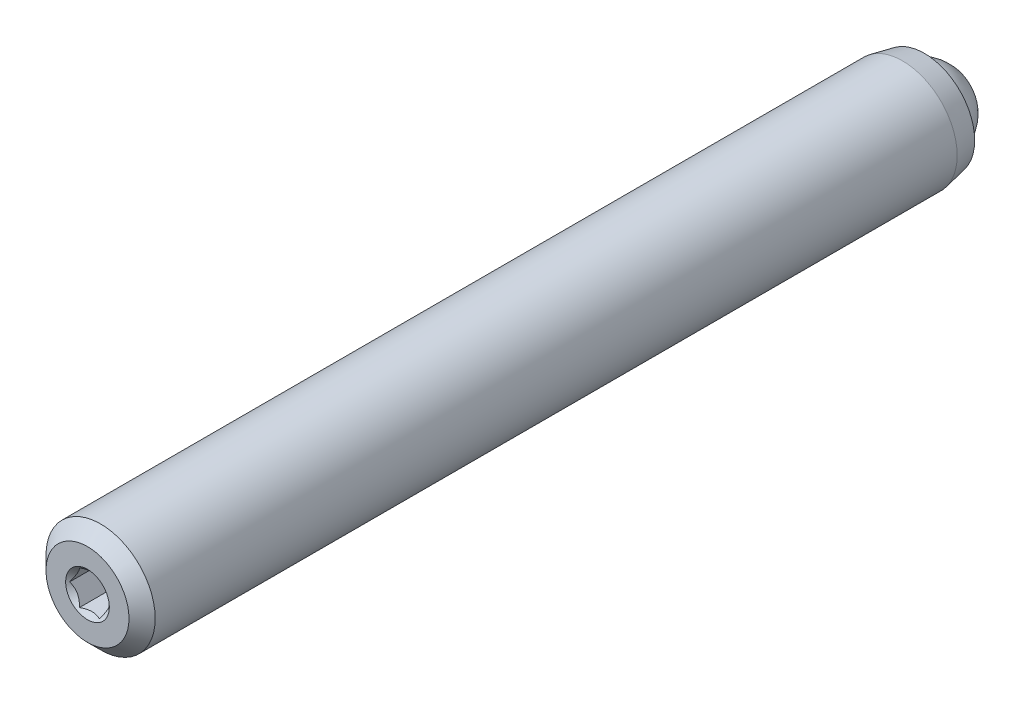
ISO-10303-21;
HEADER;
FILE_DESCRIPTION(('STEP AP214'),'2;1');
FILE_NAME('part.step','',(''),(''),'','','');
FILE_SCHEMA(('AUTOMOTIVE_DESIGN { 1 0 10303 214 1 1 1 1 }'));
ENDSEC;
DATA;
#1=APPLICATION_CONTEXT('core data for automotive mechanical design processes');
#2=APPLICATION_PROTOCOL_DEFINITION('international standard','automotive_design',2000,#1);
#3=PRODUCT_CONTEXT('',#1,'mechanical');
#4=PRODUCT('Part','Part','',(#3));
#5=PRODUCT_RELATED_PRODUCT_CATEGORY('part','',(#4));
#6=PRODUCT_DEFINITION_FORMATION('','',#4);
#7=PRODUCT_DEFINITION_CONTEXT('part definition',#1,'design');
#8=PRODUCT_DEFINITION('design','',#6,#7);
#9=PRODUCT_DEFINITION_SHAPE('','',#8);
#10=(LENGTH_UNIT() NAMED_UNIT(*) SI_UNIT(.MILLI.,.METRE.));
#11=(NAMED_UNIT(*) PLANE_ANGLE_UNIT() SI_UNIT($,.RADIAN.));
#12=(NAMED_UNIT(*) SI_UNIT($,.STERADIAN.) SOLID_ANGLE_UNIT());
#13=UNCERTAINTY_MEASURE_WITH_UNIT(LENGTH_MEASURE(1.E-05),#10,'distance_accuracy_value','');
#14=(GEOMETRIC_REPRESENTATION_CONTEXT(3) GLOBAL_UNCERTAINTY_ASSIGNED_CONTEXT((#13)) GLOBAL_UNIT_ASSIGNED_CONTEXT((#10,
#11,#12)) REPRESENTATION_CONTEXT('',''));
#15=CARTESIAN_POINT('',(0.,0.,0.));
#16=DIRECTION('',(0.,0.,1.));
#17=DIRECTION('',(1.,0.,0.));
#18=AXIS2_PLACEMENT_3D('',#15,#16,#17);
#19=CARTESIAN_POINT('',(9.74273900584421,-6.14099144723923,4.31418836824711));
#20=DIRECTION('',(0.,0.,-1.));
#21=DIRECTION('',(-1.,0.,0.));
#22=AXIS2_PLACEMENT_3D('',#19,#20,#21);
#23=PLANE('',#22);
#24=CARTESIAN_POINT('',(9.74273900584421,-6.14099144723923,4.31418836824711));
#25=DIRECTION('',(0.,0.,1.));
#26=DIRECTION('',(1.,0.,0.));
#27=AXIS2_PLACEMENT_3D('',#24,#25,#26);
#28=CIRCLE('',#27,1.27);
#29=CARTESIAN_POINT('',(11.0127390058442,-6.14099144723923,4.31418836824711));
#30=VERTEX_POINT('',#29);
#31=EDGE_CURVE('P0_E247',#30,#30,#28,.T.);
#32=ORIENTED_EDGE('',*,*,#31,.F.);
#33=EDGE_LOOP('',(#32));
#34=FACE_BOUND('',#33,.T.);
#35=CARTESIAN_POINT('',(9.74273900584421,-6.14099144723923,4.31418836824711));
#36=DIRECTION('',(0.,0.,1.));
#37=DIRECTION('',(1.,0.,0.));
#38=AXIS2_PLACEMENT_3D('',#35,#36,#37);
#39=CIRCLE('',#38,2.413);
#40=CARTESIAN_POINT('',(12.1557390058442,-6.14099144723923,4.31418836824711));
#41=VERTEX_POINT('',#40);
#42=EDGE_CURVE('P0_E162',#41,#41,#39,.T.);
#43=ORIENTED_EDGE('',*,*,#42,.T.);
#44=EDGE_LOOP('',(#43));
#45=FACE_BOUND('',#44,.T.);
#46=ADVANCED_FACE('P0_F17',(#34,#45),#23,.F.);
#47=CARTESIAN_POINT('',(9.74273900584421,-6.14099144723923,3.55218836824711));
#48=DIRECTION('',(0.,0.,-1.));
#49=DIRECTION('',(-1.,0.,0.));
#50=AXIS2_PLACEMENT_3D('',#47,#48,#49);
#51=CONICAL_SURFACE('',#50,3.175,0.785398163397448);
#52=ORIENTED_EDGE('',*,*,#42,.F.);
#53=EDGE_LOOP('',(#52));
#54=FACE_BOUND('',#53,.T.);
#55=CARTESIAN_POINT('',(9.74273900584421,-6.14099144723923,3.55218836824711));
#56=DIRECTION('',(0.,0.,1.));
#57=DIRECTION('',(1.,0.,0.));
#58=AXIS2_PLACEMENT_3D('',#55,#56,#57);
#59=CIRCLE('',#58,3.175);
#60=CARTESIAN_POINT('',(12.9177390058442,-6.14099144723923,3.55218836824711));
#61=VERTEX_POINT('',#60);
#62=EDGE_CURVE('P0_E160',#61,#61,#59,.T.);
#63=ORIENTED_EDGE('',*,*,#62,.T.);
#64=EDGE_LOOP('',(#63));
#65=FACE_BOUND('',#64,.T.);
#66=ADVANCED_FACE('P0_F311',(#54,#65),#51,.T.);
#67=CARTESIAN_POINT('',(9.74273900584421,-6.14099144723923,4.31418836824711));
#68=DIRECTION('',(0.,0.,1.));
#69=DIRECTION('',(1.,0.,0.));
#70=AXIS2_PLACEMENT_3D('',#67,#68,#69);
#71=CYLINDRICAL_SURFACE('',#70,3.175);
#72=ORIENTED_EDGE('',*,*,#62,.F.);
#73=EDGE_LOOP('',(#72));
#74=FACE_BOUND('',#73,.T.);
#75=CARTESIAN_POINT('',(9.74273900584421,-6.14099144723923,-43.0822116317529));
#76=DIRECTION('',(0.,0.,1.));
#77=DIRECTION('',(1.,0.,0.));
#78=AXIS2_PLACEMENT_3D('',#75,#76,#77);
#79=CIRCLE('',#78,3.175);
#80=CARTESIAN_POINT('',(12.9177390058442,-6.14099144723923,-43.0822116317529));
#81=VERTEX_POINT('',#80);
#82=EDGE_CURVE('P0_E157',#81,#81,#79,.T.);
#83=ORIENTED_EDGE('',*,*,#82,.T.);
#84=EDGE_LOOP('',(#83));
#85=FACE_BOUND('',#84,.T.);
#86=ADVANCED_FACE('P0_F316',(#74,#85),#71,.T.);
#87=CARTESIAN_POINT('',(9.74273900584421,-6.14099144723923,-44.3522116317529));
#88=DIRECTION('',(0.,0.,1.));
#89=DIRECTION('',(1.,0.,0.));
#90=AXIS2_PLACEMENT_3D('',#87,#88,#89);
#91=CONICAL_SURFACE('',#90,2.921,0.197395559849881);
#92=ORIENTED_EDGE('',*,*,#82,.F.);
#93=EDGE_LOOP('',(#92));
#94=FACE_BOUND('',#93,.T.);
#95=CARTESIAN_POINT('',(9.74273900584421,-6.14099144723923,-44.3522116317529));
#96=DIRECTION('',(0.,0.,1.));
#97=DIRECTION('',(1.,0.,0.));
#98=AXIS2_PLACEMENT_3D('',#95,#96,#97);
#99=CIRCLE('',#98,2.921);
#100=CARTESIAN_POINT('',(12.6637390058442,-6.14099144723923,-44.3522116317529));
#101=VERTEX_POINT('',#100);
#102=EDGE_CURVE('P0_E154',#101,#101,#99,.T.);
#103=ORIENTED_EDGE('',*,*,#102,.T.);
#104=EDGE_LOOP('',(#103));
#105=FACE_BOUND('',#104,.T.);
#106=ADVANCED_FACE('P0_F322',(#94,#105),#91,.T.);
#107=CARTESIAN_POINT('',(9.74273900584421,-3.21999144723923,-44.3522116317529));
#108=DIRECTION('',(0.,0.,1.));
#109=DIRECTION('',(1.,0.,0.));
#110=AXIS2_PLACEMENT_3D('',#107,#108,#109);
#111=PLANE('',#110);
#112=ORIENTED_EDGE('',*,*,#102,.F.);
#113=EDGE_LOOP('',(#112));
#114=FACE_BOUND('',#113,.T.);
#115=CARTESIAN_POINT('',(9.74273900584421,-6.14099144723923,-44.3522116317529));
#116=DIRECTION('',(0.,0.,1.));
#117=DIRECTION('',(1.,0.,0.));
#118=AXIS2_PLACEMENT_3D('',#115,#116,#117);
#119=CIRCLE('',#118,2.3876);
#120=CARTESIAN_POINT('',(12.1303390058442,-6.14099144723923,-44.3522116317529));
#121=VERTEX_POINT('',#120);
#122=EDGE_CURVE('P0_E151',#121,#121,#119,.T.);
#123=ORIENTED_EDGE('',*,*,#122,.T.);
#124=EDGE_LOOP('',(#123));
#125=FACE_BOUND('',#124,.T.);
#126=ADVANCED_FACE('P0_F329',(#114,#125),#111,.F.);
#127=CARTESIAN_POINT('',(9.74273900584421,-6.14099144723923,4.31418836824711));
#128=DIRECTION('',(0.,0.,1.));
#129=DIRECTION('',(1.,0.,0.));
#130=AXIS2_PLACEMENT_3D('',#127,#128,#129);
#131=CYLINDRICAL_SURFACE('',#130,2.3876);
#132=ORIENTED_EDGE('',*,*,#122,.F.);
#133=EDGE_LOOP('',(#132));
#134=FACE_BOUND('',#133,.T.);
#135=CARTESIAN_POINT('',(9.74273900584421,-6.14099144723923,-43.124565586352));
#136=DIRECTION('',(0.,0.,1.));
#137=DIRECTION('',(1.,0.,0.));
#138=AXIS2_PLACEMENT_3D('',#135,#136,#137);
#139=CIRCLE('',#138,2.3876);
#140=CARTESIAN_POINT('',(12.1303390058442,-6.14099144723923,-43.124565586352));
#141=VERTEX_POINT('',#140);
#142=EDGE_CURVE('P0_E148',#141,#141,#139,.T.);
#143=ORIENTED_EDGE('',*,*,#142,.T.);
#144=EDGE_LOOP('',(#143));
#145=FACE_BOUND('',#144,.T.);
#146=ADVANCED_FACE('P0_F333',(#134,#145),#131,.F.);
#147=CARTESIAN_POINT('',(9.74273900584421,-6.14099144723923,-40.7369655863519));
#148=DIRECTION('',(0.,0.,-1.));
#149=DIRECTION('',(-1.,0.,0.));
#150=AXIS2_PLACEMENT_3D('',#147,#148,#149);
#151=CONICAL_SURFACE('',#150,0.,0.785398163397443);
#152=ORIENTED_EDGE('',*,*,#142,.F.);
#153=EDGE_LOOP('',(#152));
#154=FACE_BOUND('',#153,.T.);
#155=CARTESIAN_POINT('',(9.74273900584421,-6.14099144723923,-40.7369655863519));
#156=VERTEX_POINT('',#155);
#157=VERTEX_LOOP('',#156);
#158=FACE_BOUND('',#157,.T.);
#159=ADVANCED_FACE('P0_F269',(#154,#158),#151,.F.);
#160=CARTESIAN_POINT('',(9.74273900584421,-6.14099144723923,3.04418836824709));
#161=DIRECTION('',(0.,0.,1.));
#162=DIRECTION('',(1.,0.,0.));
#163=AXIS2_PLACEMENT_3D('',#160,#161,#162);
#164=CONICAL_SURFACE('',#163,0.,0.785398163397443);
#165=ORIENTED_EDGE('',*,*,#31,.T.);
#166=EDGE_LOOP('',(#165));
#167=FACE_BOUND('',#166,.T.);
#168=CARTESIAN_POINT('',(10.8975550142773,-6.14079144723923,4.19900439399897));
#169=CARTESIAN_POINT('',(10.8777042137945,-6.17517404224641,4.17916683745209));
#170=CARTESIAN_POINT('',(10.8575214784036,-6.21013156537905,4.16049392726525));
#171=CARTESIAN_POINT('',(10.8163664011364,-6.28141425019532,4.12630364934952));
#172=CARTESIAN_POINT('',(10.795390141425,-6.31774619776821,4.11080531564982));
#173=CARTESIAN_POINT('',(10.7530923849422,-6.39100806104254,4.08425621376862));
#174=CARTESIAN_POINT('',(10.7317816719535,-6.42791929868464,4.07313868062328));
#175=CARTESIAN_POINT('',(10.6886912051269,-6.50255417655008,4.05600877240254));
#176=CARTESIAN_POINT('',(10.6669127684708,-6.54027553534786,4.04998360409303));
#177=CARTESIAN_POINT('',(10.6293803184842,-6.60528364565716,4.04454946159385));
#178=CARTESIAN_POINT('',(10.6136751365165,-6.6324858187674,4.04374584494309));
#179=CARTESIAN_POINT('',(10.5822951857071,-6.68683748790834,4.04509560604324));
#180=CARTESIAN_POINT('',(10.5666204243391,-6.7139869709941,4.04724963617355));
#181=CARTESIAN_POINT('',(10.5198199764436,-6.79504772456618,4.05800587875483));
#182=CARTESIAN_POINT('',(10.4889271969606,-6.84855558821765,4.07090346304171));
#183=CARTESIAN_POINT('',(10.4347071222639,-6.94246751238265,4.10202963722853));
#184=CARTESIAN_POINT('',(10.4111255631376,-6.98331197091106,4.11862670432819));
#185=CARTESIAN_POINT('',(10.3648860917779,-7.06340108462117,4.15601383131165));
#186=CARTESIAN_POINT('',(10.3422254554288,-7.10265045810967,4.17679024844376));
#187=CARTESIAN_POINT('',(10.31997380498,-7.14119144723923,4.19900439399897));
#188=B_SPLINE_CURVE_WITH_KNOTS('',3,(#168,#169,#170,#171,#172,#173,#174,#175,#176,#177,#178,
#179,#180,#181,#182,#183,#184,#185,#186,#187),.UNSPECIFIED.,.F.,.F.,(4,2,2,2,2,2,2,2,2,4),(0.,
0.133237676828557,0.267252229834487,0.399137076269296,0.530689603280762,0.62481486426384,
0.718960890149123,0.907306626112085,1.05710100361789,1.20641411519286),.UNSPECIFIED.);
#189=CARTESIAN_POINT('',(10.8974395442235,-6.14099144723923,4.19888890662636));
#190=VERTEX_POINT('',#189);
#191=CARTESIAN_POINT('',(10.3200892750338,-7.14099144723923,4.19888890662636));
#192=VERTEX_POINT('',#191);
#193=EDGE_CURVE('P0_E115',#190,#192,#188,.T.);
#194=ORIENTED_EDGE('',*,*,#193,.T.);
#195=CARTESIAN_POINT('',(8.51031050264178,-7.14099144723923,4.63128635372431));
#196=CARTESIAN_POINT('',(8.53998270076168,-7.14099144723923,4.6082484072783));
#197=CARTESIAN_POINT('',(8.56981104218133,-7.14099144723923,4.58541224539767));
#198=CARTESIAN_POINT('',(8.62984623000346,-7.14099144723923,4.54022912420729));
#199=CARTESIAN_POINT('',(8.66005316098693,-7.14099144723923,4.51788227739346));
#200=CARTESIAN_POINT('',(8.75178228815565,-7.14099144723923,4.45138534315059));
#201=CARTESIAN_POINT('',(8.81396452758707,-7.14099144723923,4.40813118503922));
#202=CARTESIAN_POINT('',(8.94491067802644,-7.14099144723923,4.32243125889816));
#203=CARTESIAN_POINT('',(9.0138370880217,-7.14099144723923,4.28023129139766));
#204=CARTESIAN_POINT('',(9.1552277602692,-7.14099144723923,4.20250206004232));
#205=CARTESIAN_POINT('',(9.2276789876563,-7.14099144723923,4.16695027043341));
#206=CARTESIAN_POINT('',(9.33568526371046,-7.14099144723923,4.12343424897431));
#207=CARTESIAN_POINT('',(9.36946583509232,-7.14099144723923,4.11109208210914));
#208=CARTESIAN_POINT('',(9.43791348520493,-7.14099144723923,4.08911273309591));
#209=CARTESIAN_POINT('',(9.47258061828307,-7.14099144723923,4.07947571721293));
#210=CARTESIAN_POINT('',(9.54196768302015,-7.14099144723923,4.06359667679777));
#211=CARTESIAN_POINT('',(9.57667273054637,-7.14099144723923,4.05729068819748));
#212=CARTESIAN_POINT('',(9.64655556321643,-7.14099144723923,4.04820649951787));
#213=CARTESIAN_POINT('',(9.68173339199748,-7.14099144723923,4.04542862737143));
#214=CARTESIAN_POINT('',(9.75049884638581,-7.14099144723923,4.04365606128879));
#215=CARTESIAN_POINT('',(9.78408198766287,-7.14099144723923,4.04448663999703));
#216=CARTESIAN_POINT('',(9.85098674621754,-7.14099144723923,4.04947664020862));
#217=CARTESIAN_POINT('',(9.88430842694802,-7.14099144723923,4.05363522712564));
#218=CARTESIAN_POINT('',(9.95103294348463,-7.14099144723923,4.06511190720631));
#219=CARTESIAN_POINT('',(9.9844257508201,-7.14099144723923,4.0724873543785));
#220=CARTESIAN_POINT('',(10.0504690645772,-7.14099144723923,4.08998167117632));
#221=CARTESIAN_POINT('',(10.0831196023826,-7.14099144723923,4.10010042457841));
#222=CARTESIAN_POINT('',(10.1825456951086,-7.14099144723923,4.13481096722407));
#223=CARTESIAN_POINT('',(10.2479876912246,-7.14099144723923,4.16320979591341));
#224=CARTESIAN_POINT('',(10.3758211422022,-7.14099144723923,4.2264268050646));
#225=CARTESIAN_POINT('',(10.4382009512613,-7.14099144723923,4.26126740155543));
#226=CARTESIAN_POINT('',(10.5574517880454,-7.14099144723923,4.33322605051449));
#227=CARTESIAN_POINT('',(10.6144428478589,-7.14099144723923,4.37014770752134));
#228=CARTESIAN_POINT('',(10.6984071950102,-7.14099144723923,4.42726054299713));
#229=CARTESIAN_POINT('',(10.7260346918042,-7.14099144723923,4.44650660504177));
#230=CARTESIAN_POINT('',(10.7809102254266,-7.14099144723923,4.48551716451218));
#231=CARTESIAN_POINT('',(10.8081583642475,-7.14099144723923,4.50528151830436));
#232=CARTESIAN_POINT('',(10.8352481880904,-7.14099144723923,4.52526105832419));
#233=B_SPLINE_CURVE_WITH_KNOTS('',3,(#195,#196,#197,#198,#199,#200,#201,#202,#203,#204,#205,
#206,#207,#208,#209,#210,#211,#212,#213,#214,#215,#216,#217,#218,#219,#220,#221,#222,#223,#224,
#225,#226,#227,#228,#229,#230,#231,#232),.UNSPECIFIED.,.F.,.F.,(4,2,2,2,2,2,2,2,2,2,2,2,2,2,2,2,
2,2,4),(0.,0.112694635133697,0.225414912901259,0.452565111221723,0.69484715433076,
0.936292788451031,1.04409719829335,1.15190823260368,1.25756594597726,1.36323347935069,
1.46384294190014,1.56442718186177,1.6668831555875,1.76933478931797,1.9827289310954,
2.19688011504817,2.40049475727374,2.50150167541717,2.60248089143825),.UNSPECIFIED.);
#234=CARTESIAN_POINT('',(9.16538873665459,-7.14099144723923,4.19888890662636));
#235=VERTEX_POINT('',#234);
#236=EDGE_CURVE('P0_E131',#192,#235,#233,.F.);
#237=ORIENTED_EDGE('',*,*,#236,.T.);
#238=CARTESIAN_POINT('',(9.16550420670843,-7.14119144723923,4.19900439399897));
#239=CARTESIAN_POINT('',(9.14565340622559,-7.10680885223205,4.17916683745209));
#240=CARTESIAN_POINT('',(9.12547067083476,-7.07185132909941,4.16049392726525));
#241=CARTESIAN_POINT('',(9.08431559356753,-7.00056864428314,4.12630364934951));
#242=CARTESIAN_POINT('',(9.06333933385613,-6.96423669671025,4.11080531564981));
#243=CARTESIAN_POINT('',(9.02104157737337,-6.89097483343592,4.08425621376862));
#244=CARTESIAN_POINT('',(8.99973086438458,-6.85406359579382,4.07313868062328));
#245=CARTESIAN_POINT('',(8.95664039755803,-6.77942871792838,4.05600877240254));
#246=CARTESIAN_POINT('',(8.93486196090194,-6.7417073591306,4.04998360409303));
#247=CARTESIAN_POINT('',(8.89732951091536,-6.6766992488213,4.04454946159385));
#248=CARTESIAN_POINT('',(8.88162432894762,-6.64949707571106,4.04374584494309));
#249=CARTESIAN_POINT('',(8.85024437813819,-6.59514540657012,4.04509560604324));
#250=CARTESIAN_POINT('',(8.83456961677027,-6.56799592348436,4.04724963617355));
#251=CARTESIAN_POINT('',(8.78776916887471,-6.48693516991228,4.05800587875482));
#252=CARTESIAN_POINT('',(8.75687638939177,-6.43342730626081,4.07090346304171));
#253=CARTESIAN_POINT('',(8.70265631469499,-6.33951538209581,4.10202963722853));
#254=CARTESIAN_POINT('',(8.67907475556871,-6.2986709235674,4.11862670432819));
#255=CARTESIAN_POINT('',(8.63283528420902,-6.21858180985729,4.15601383131165));
#256=CARTESIAN_POINT('',(8.61017464785992,-6.17933243636879,4.17679024844376));
#257=CARTESIAN_POINT('',(8.58792299741113,-6.14079144723923,4.19900439399897));
#258=B_SPLINE_CURVE_WITH_KNOTS('',3,(#238,#239,#240,#241,#242,#243,#244,#245,#246,#247,#248,
#249,#250,#251,#252,#253,#254,#255,#256,#257),.UNSPECIFIED.,.F.,.F.,(4,2,2,2,2,2,2,2,2,4),(0.,
0.133237676828558,0.267252229834487,0.399137076269296,0.530689603280762,0.624814864263839,
0.718960890149124,0.907306626112085,1.05710100361789,1.20641411519286),.UNSPECIFIED.);
#259=CARTESIAN_POINT('',(8.58803846746496,-6.14099144723923,4.19888890662636));
#260=VERTEX_POINT('',#259);
#261=EDGE_CURVE('P0_E249',#235,#260,#258,.T.);
#262=ORIENTED_EDGE('',*,*,#261,.T.);
#263=CARTESIAN_POINT('',(8.58792299741113,-6.14119144723923,4.19900439399897));
#264=CARTESIAN_POINT('',(8.60777379789396,-6.10680885223205,4.17916683745209));
#265=CARTESIAN_POINT('',(8.62795653328479,-6.07185132909941,4.16049392726525));
#266=CARTESIAN_POINT('',(8.66911161055202,-6.00056864428314,4.12630364934952));
#267=CARTESIAN_POINT('',(8.69008787026342,-5.96423669671025,4.11080531564982));
#268=CARTESIAN_POINT('',(8.73238562674618,-5.89097483343592,4.08425621376862));
#269=CARTESIAN_POINT('',(8.75369633973497,-5.85406359579382,4.07313868062328));
#270=CARTESIAN_POINT('',(8.79678680656152,-5.77942871792838,4.05600877240254));
#271=CARTESIAN_POINT('',(8.81856524321761,-5.7417073591306,4.04998360409303));
#272=CARTESIAN_POINT('',(8.8560976932042,-5.6766992488213,4.04454946159385));
#273=CARTESIAN_POINT('',(8.87180287517194,-5.64949707571106,4.04374584494309));
#274=CARTESIAN_POINT('',(8.90318282598136,-5.59514540657012,4.04509560604324));
#275=CARTESIAN_POINT('',(8.91885758734929,-5.56799592348436,4.04724963617355));
#276=CARTESIAN_POINT('',(8.96565803524484,-5.48693516991228,4.05800587875482));
#277=CARTESIAN_POINT('',(8.99655081472778,-5.43342730626081,4.07090346304171));
#278=CARTESIAN_POINT('',(9.05077088942456,-5.33951538209581,4.10202963722853));
#279=CARTESIAN_POINT('',(9.07435244855084,-5.2986709235674,4.11862670432819));
#280=CARTESIAN_POINT('',(9.12059191991053,-5.21858180985729,4.15601383131165));
#281=CARTESIAN_POINT('',(9.14325255625964,-5.17933243636879,4.17679024844376));
#282=CARTESIAN_POINT('',(9.16550420670843,-5.14079144723923,4.19900439399897));
#283=B_SPLINE_CURVE_WITH_KNOTS('',3,(#263,#264,#265,#266,#267,#268,#269,#270,#271,#272,#273,
#274,#275,#276,#277,#278,#279,#280,#281,#282),.UNSPECIFIED.,.F.,.F.,(4,2,2,2,2,2,2,2,2,4),(0.,
0.133237676828556,0.267252229834488,0.399137076269295,0.530689603280762,0.624814864263839,
0.718960890149123,0.907306626112083,1.05710100361789,1.20641411519286),.UNSPECIFIED.);
#284=CARTESIAN_POINT('',(9.16538873665459,-5.14099144723923,4.19888890662636));
#285=VERTEX_POINT('',#284);
#286=EDGE_CURVE('P0_E241',#260,#285,#283,.T.);
#287=ORIENTED_EDGE('',*,*,#286,.T.);
#288=CARTESIAN_POINT('',(8.51031050264178,-5.14099144723923,4.63128635372431));
#289=CARTESIAN_POINT('',(8.53998270076168,-5.14099144723923,4.6082484072783));
#290=CARTESIAN_POINT('',(8.56981104218133,-5.14099144723923,4.58541224539767));
#291=CARTESIAN_POINT('',(8.62984623000346,-5.14099144723923,4.54022912420729));
#292=CARTESIAN_POINT('',(8.66005316098693,-5.14099144723923,4.51788227739346));
#293=CARTESIAN_POINT('',(8.75178228815565,-5.14099144723923,4.45138534315059));
#294=CARTESIAN_POINT('',(8.81396452758707,-5.14099144723923,4.40813118503922));
#295=CARTESIAN_POINT('',(8.94491067802644,-5.14099144723923,4.32243125889816));
#296=CARTESIAN_POINT('',(9.01383708802169,-5.14099144723923,4.28023129139766));
#297=CARTESIAN_POINT('',(9.1552277602692,-5.14099144723923,4.20250206004232));
#298=CARTESIAN_POINT('',(9.2276789876563,-5.14099144723923,4.16695027043341));
#299=CARTESIAN_POINT('',(9.33568526371046,-5.14099144723923,4.12343424897431));
#300=CARTESIAN_POINT('',(9.36946583509232,-5.14099144723923,4.11109208210914));
#301=CARTESIAN_POINT('',(9.43791348520493,-5.14099144723923,4.08911273309591));
#302=CARTESIAN_POINT('',(9.47258061828307,-5.14099144723923,4.07947571721293));
#303=CARTESIAN_POINT('',(9.54196768302015,-5.14099144723923,4.06359667679777));
#304=CARTESIAN_POINT('',(9.57667273054637,-5.14099144723923,4.05729068819748));
#305=CARTESIAN_POINT('',(9.64655556321643,-5.14099144723923,4.04820649951787));
#306=CARTESIAN_POINT('',(9.68173339199748,-5.14099144723923,4.04542862737143));
#307=CARTESIAN_POINT('',(9.75049884638581,-5.14099144723923,4.04365606128879));
#308=CARTESIAN_POINT('',(9.78408198766287,-5.14099144723923,4.04448663999703));
#309=CARTESIAN_POINT('',(9.85098674621754,-5.14099144723923,4.04947664020862));
#310=CARTESIAN_POINT('',(9.88430842694802,-5.14099144723923,4.05363522712564));
#311=CARTESIAN_POINT('',(9.95103294348463,-5.14099144723923,4.06511190720631));
#312=CARTESIAN_POINT('',(9.9844257508201,-5.14099144723923,4.0724873543785));
#313=CARTESIAN_POINT('',(10.0504690645772,-5.14099144723923,4.08998167117632));
#314=CARTESIAN_POINT('',(10.0831196023826,-5.14099144723923,4.10010042457841));
#315=CARTESIAN_POINT('',(10.1825456951086,-5.14099144723923,4.13481096722407));
#316=CARTESIAN_POINT('',(10.2479876912246,-5.14099144723923,4.16320979591341));
#317=CARTESIAN_POINT('',(10.3758211422022,-5.14099144723923,4.2264268050646));
#318=CARTESIAN_POINT('',(10.4382009512613,-5.14099144723923,4.26126740155544));
#319=CARTESIAN_POINT('',(10.5574517880454,-5.14099144723923,4.3332260505145));
#320=CARTESIAN_POINT('',(10.6144428478589,-5.14099144723923,4.37014770752134));
#321=CARTESIAN_POINT('',(10.6984071950102,-5.14099144723923,4.42726054299713));
#322=CARTESIAN_POINT('',(10.7260346918042,-5.14099144723923,4.44650660504178));
#323=CARTESIAN_POINT('',(10.7809102254266,-5.14099144723923,4.48551716451218));
#324=CARTESIAN_POINT('',(10.8081583642475,-5.14099144723923,4.50528151830437));
#325=CARTESIAN_POINT('',(10.8352481880904,-5.14099144723923,4.52526105832419));
#326=B_SPLINE_CURVE_WITH_KNOTS('',3,(#288,#289,#290,#291,#292,#293,#294,#295,#296,#297,#298,
#299,#300,#301,#302,#303,#304,#305,#306,#307,#308,#309,#310,#311,#312,#313,#314,#315,#316,#317,
#318,#319,#320,#321,#322,#323,#324,#325),.UNSPECIFIED.,.F.,.F.,(4,2,2,2,2,2,2,2,2,2,2,2,2,2,2,2,
2,2,4),(0.,0.112694635133697,0.225414912901259,0.452565111221722,0.694847154330758,
0.936292788451031,1.04409719829335,1.15190823260368,1.25756594597726,1.36323347935069,
1.46384294190014,1.56442718186177,1.6668831555875,1.76933478931797,1.9827289310954,
2.19688011504817,2.40049475727374,2.50150167541718,2.60248089143825),.UNSPECIFIED.);
#327=CARTESIAN_POINT('',(10.3200892750338,-5.14099144723923,4.19888890662636));
#328=VERTEX_POINT('',#327);
#329=EDGE_CURVE('P0_E36',#285,#328,#326,.T.);
#330=ORIENTED_EDGE('',*,*,#329,.T.);
#331=CARTESIAN_POINT('',(10.31997380498,-5.14079144723923,4.19900439399897));
#332=CARTESIAN_POINT('',(10.3398246054628,-5.17517404224641,4.17916683745209));
#333=CARTESIAN_POINT('',(10.3600073408537,-5.21013156537905,4.16049392726525));
#334=CARTESIAN_POINT('',(10.4011624181209,-5.28141425019532,4.12630364934952));
#335=CARTESIAN_POINT('',(10.4221386778323,-5.31774619776821,4.11080531564982));
#336=CARTESIAN_POINT('',(10.4644364343151,-5.39100806104254,4.08425621376862));
#337=CARTESIAN_POINT('',(10.4857471473038,-5.42791929868464,4.07313868062328));
#338=CARTESIAN_POINT('',(10.5288376141304,-5.50255417655008,4.05600877240254));
#339=CARTESIAN_POINT('',(10.5506160507865,-5.54027553534786,4.04998360409303));
#340=CARTESIAN_POINT('',(10.5881485007731,-5.60528364565716,4.04454946159385));
#341=CARTESIAN_POINT('',(10.6038536827408,-5.6324858187674,4.04374584494309));
#342=CARTESIAN_POINT('',(10.6352336335502,-5.68683748790833,4.04509560604324));
#343=CARTESIAN_POINT('',(10.6509083949182,-5.7139869709941,4.04724963617355));
#344=CARTESIAN_POINT('',(10.6977088428137,-5.79504772456618,4.05800587875482));
#345=CARTESIAN_POINT('',(10.7286016222967,-5.84855558821765,4.07090346304171));
#346=CARTESIAN_POINT('',(10.7828216969934,-5.94246751238265,4.10202963722853));
#347=CARTESIAN_POINT('',(10.8064032561197,-5.98331197091106,4.11862670432819));
#348=CARTESIAN_POINT('',(10.8526427274794,-6.06340108462117,4.15601383131165));
#349=CARTESIAN_POINT('',(10.8753033638285,-6.10265045810967,4.17679024844376));
#350=CARTESIAN_POINT('',(10.8975550142773,-6.14119144723923,4.19900439399897));
#351=B_SPLINE_CURVE_WITH_KNOTS('',3,(#331,#332,#333,#334,#335,#336,#337,#338,#339,#340,#341,
#342,#343,#344,#345,#346,#347,#348,#349,#350),.UNSPECIFIED.,.F.,.F.,(4,2,2,2,2,2,2,2,2,4),(0.,
0.133237676828558,0.267252229834489,0.399137076269297,0.530689603280763,0.624814864263838,
0.718960890149123,0.907306626112084,1.05710100361789,1.20641411519286),.UNSPECIFIED.);
#352=EDGE_CURVE('P0_E11',#328,#190,#351,.T.);
#353=ORIENTED_EDGE('',*,*,#352,.T.);
#354=EDGE_LOOP('',(#194,#237,#262,#287,#330,#353));
#355=FACE_BOUND('',#354,.T.);
#356=ADVANCED_FACE('P0_F114',(#167,#355),#164,.F.);
#357=CARTESIAN_POINT('',(9.74273900584421,-6.14099144723923,0.351788368247108));
#358=DIRECTION('',(0.,0.,1.));
#359=DIRECTION('',(1.,0.,0.));
#360=AXIS2_PLACEMENT_3D('',#357,#358,#359);
#361=CONICAL_SURFACE('',#360,1.0414,1.02974425867665);
#362=CARTESIAN_POINT('',(9.74273900584421,-6.14099144723923,-0.273947880408193));
#363=VERTEX_POINT('',#362);
#364=VERTEX_LOOP('',#363);
#365=FACE_BOUND('',#364,.T.);
#366=CARTESIAN_POINT('',(9.74273900584421,-6.14099144723923,0.351788368247108));
#367=DIRECTION('',(0.,0.,1.));
#368=DIRECTION('',(1.,0.,0.));
#369=AXIS2_PLACEMENT_3D('',#366,#367,#368);
#370=CIRCLE('',#369,1.0414);
#371=CARTESIAN_POINT('',(10.7841390058442,-6.14099144723923,0.351788368247108));
#372=VERTEX_POINT('',#371);
#373=EDGE_CURVE('P0_E175',#372,#372,#370,.T.);
#374=ORIENTED_EDGE('',*,*,#373,.T.);
#375=EDGE_LOOP('',(#374));
#376=FACE_BOUND('',#375,.T.);
#377=ADVANCED_FACE('P0_F268',(#365,#376),#361,.F.);
#378=CARTESIAN_POINT('',(9.74273900584421,-6.14099144723923,1.26618836824711));
#379=DIRECTION('',(0.,0.,1.));
#380=DIRECTION('',(1.,0.,0.));
#381=AXIS2_PLACEMENT_3D('',#378,#379,#380);
#382=CYLINDRICAL_SURFACE('',#381,1.0414);
#383=ORIENTED_EDGE('',*,*,#373,.F.);
#384=EDGE_LOOP('',(#383));
#385=FACE_BOUND('',#384,.T.);
#386=CARTESIAN_POINT('',(9.74273900584421,-6.14099144723923,1.26618836824711));
#387=DIRECTION('',(0.,0.,1.));
#388=DIRECTION('',(1.,0.,0.));
#389=AXIS2_PLACEMENT_3D('',#386,#387,#388);
#390=CIRCLE('',#389,1.0414);
#391=CARTESIAN_POINT('',(10.7541208336353,-5.89275615882527,1.26618836824711));
#392=VERTEX_POINT('',#391);
#393=CARTESIAN_POINT('',(10.463407985622,-5.38922673565319,1.26618836824711));
#394=VERTEX_POINT('',#393);
#395=EDGE_CURVE('P0_E169',#392,#394,#390,.T.);
#396=ORIENTED_EDGE('',*,*,#395,.T.);
#397=CARTESIAN_POINT('',(10.0334518538575,-5.14099144723923,1.26618836824711));
#398=VERTEX_POINT('',#397);
#399=EDGE_CURVE('P0_E30',#394,#398,#390,.T.);
#400=ORIENTED_EDGE('',*,*,#399,.T.);
#401=CARTESIAN_POINT('',(9.45202615783092,-5.14099144723923,1.26618836824711));
#402=VERTEX_POINT('',#401);
#403=EDGE_CURVE('P0_E176',#398,#402,#390,.T.);
#404=ORIENTED_EDGE('',*,*,#403,.T.);
#405=CARTESIAN_POINT('',(9.02207002606642,-5.3892267356532,1.26618836824711));
#406=VERTEX_POINT('',#405);
#407=EDGE_CURVE('P0_E198',#402,#406,#390,.T.);
#408=ORIENTED_EDGE('',*,*,#407,.T.);
#409=CARTESIAN_POINT('',(8.73135717805313,-5.89275615882527,1.26618836824711));
#410=VERTEX_POINT('',#409);
#411=EDGE_CURVE('P0_E182',#406,#410,#390,.T.);
#412=ORIENTED_EDGE('',*,*,#411,.T.);
#413=CARTESIAN_POINT('',(8.73135717805313,-6.3892267356532,1.26618836824711));
#414=VERTEX_POINT('',#413);
#415=EDGE_CURVE('P0_E195',#410,#414,#390,.T.);
#416=ORIENTED_EDGE('',*,*,#415,.T.);
#417=CARTESIAN_POINT('',(9.02207002606642,-6.89275615882527,1.26618836824711));
#418=VERTEX_POINT('',#417);
#419=EDGE_CURVE('P0_E185',#414,#418,#390,.T.);
#420=ORIENTED_EDGE('',*,*,#419,.T.);
#421=CARTESIAN_POINT('',(9.45202615783092,-7.14099144723923,1.26618836824711));
#422=VERTEX_POINT('',#421);
#423=EDGE_CURVE('P0_E173',#418,#422,#390,.T.);
#424=ORIENTED_EDGE('',*,*,#423,.T.);
#425=CARTESIAN_POINT('',(10.0334518538575,-7.14099144723923,1.26618836824711));
#426=VERTEX_POINT('',#425);
#427=EDGE_CURVE('P0_E183',#422,#426,#390,.T.);
#428=ORIENTED_EDGE('',*,*,#427,.T.);
#429=CARTESIAN_POINT('',(10.463407985622,-6.89275615882526,1.26618836824711));
#430=VERTEX_POINT('',#429);
#431=EDGE_CURVE('P0_E167',#426,#430,#390,.T.);
#432=ORIENTED_EDGE('',*,*,#431,.T.);
#433=CARTESIAN_POINT('',(10.7541208336353,-6.3892267356532,1.26618836824711));
#434=VERTEX_POINT('',#433);
#435=EDGE_CURVE('P0_E44',#430,#434,#390,.T.);
#436=ORIENTED_EDGE('',*,*,#435,.T.);
#437=EDGE_CURVE('P0_E164',#434,#392,#390,.T.);
#438=ORIENTED_EDGE('',*,*,#437,.T.);
#439=EDGE_LOOP('',(#396,#400,#404,#408,#412,#416,#420,#424,#428,#432,#436,#438));
#440=FACE_BOUND('',#439,.T.);
#441=ADVANCED_FACE('P0_F194',(#385,#440),#382,.F.);
#442=CARTESIAN_POINT('',(10.7841390058442,-6.14099144723923,1.26618836824711));
#443=DIRECTION('',(0.,0.,1.));
#444=DIRECTION('',(1.,0.,0.));
#445=AXIS2_PLACEMENT_3D('',#442,#443,#444);
#446=PLANE('',#445);
#447=DIRECTION('',(0.5,0.866025403784439,0.));
#448=VECTOR('',#447,1.);
#449=CARTESIAN_POINT('',(10.3200892750338,-7.14099144723923,1.26618836824711));
#450=LINE('',#449,#448);
#451=EDGE_CURVE('P0_E400',#430,#434,#450,.T.);
#452=ORIENTED_EDGE('',*,*,#451,.T.);
#453=ORIENTED_EDGE('',*,*,#435,.F.);
#454=EDGE_LOOP('',(#452,#453));
#455=FACE_BOUND('',#454,.T.);
#456=ADVANCED_FACE('P0_F356',(#455),#446,.F.);
#457=DIRECTION('',(1.,0.,0.));
#458=VECTOR('',#457,1.);
#459=CARTESIAN_POINT('',(9.16538873665459,-7.14099144723923,1.26618836824711));
#460=LINE('',#459,#458);
#461=EDGE_CURVE('P0_E143',#422,#426,#460,.T.);
#462=ORIENTED_EDGE('',*,*,#461,.T.);
#463=ORIENTED_EDGE('',*,*,#427,.F.);
#464=EDGE_LOOP('',(#462,#463));
#465=FACE_BOUND('',#464,.T.);
#466=ADVANCED_FACE('P0_F365',(#465),#446,.F.);
#467=CARTESIAN_POINT('',(9.74273900584421,-6.14099144723923,1.26618836824711));
#468=DIRECTION('',(0.,0.,1.));
#469=DIRECTION('',(1.,0.,0.));
#470=AXIS2_PLACEMENT_3D('',#467,#468,#469);
#471=PLANE('',#470);
#472=ORIENTED_EDGE('',*,*,#431,.F.);
#473=CARTESIAN_POINT('',(10.3200892750338,-7.14099144723923,1.26618836824711));
#474=VERTEX_POINT('',#473);
#475=EDGE_CURVE('P0_E145',#426,#474,#460,.T.);
#476=ORIENTED_EDGE('',*,*,#475,.T.);
#477=EDGE_CURVE('P0_E401',#474,#430,#450,.T.);
#478=ORIENTED_EDGE('',*,*,#477,.T.);
#479=EDGE_LOOP('',(#472,#476,#478));
#480=FACE_BOUND('',#479,.T.);
#481=ADVANCED_FACE('P0_F360',(#480),#471,.T.);
#482=DIRECTION('',(0.5,-0.866025403784439,0.));
#483=VECTOR('',#482,1.);
#484=CARTESIAN_POINT('',(8.58803846746496,-6.14099144723923,1.26618836824711));
#485=LINE('',#484,#483);
#486=EDGE_CURVE('P0_E227',#414,#418,#485,.T.);
#487=ORIENTED_EDGE('',*,*,#486,.T.);
#488=ORIENTED_EDGE('',*,*,#419,.F.);
#489=EDGE_LOOP('',(#487,#488));
#490=FACE_BOUND('',#489,.T.);
#491=ADVANCED_FACE('P0_F364',(#490),#446,.F.);
#492=ORIENTED_EDGE('',*,*,#423,.F.);
#493=CARTESIAN_POINT('',(9.16538873665459,-7.14099144723923,1.26618836824711));
#494=VERTEX_POINT('',#493);
#495=EDGE_CURVE('P0_E225',#418,#494,#485,.T.);
#496=ORIENTED_EDGE('',*,*,#495,.T.);
#497=EDGE_CURVE('P0_E138',#494,#422,#460,.T.);
#498=ORIENTED_EDGE('',*,*,#497,.T.);
#499=EDGE_LOOP('',(#492,#496,#498));
#500=FACE_BOUND('',#499,.T.);
#501=ADVANCED_FACE('P0_F366',(#500),#471,.T.);
#502=DIRECTION('',(-0.5,-0.866025403784439,0.));
#503=VECTOR('',#502,1.);
#504=CARTESIAN_POINT('',(9.16538873665459,-5.14099144723923,1.26618836824711));
#505=LINE('',#504,#503);
#506=EDGE_CURVE('P0_E213',#406,#410,#505,.T.);
#507=ORIENTED_EDGE('',*,*,#506,.T.);
#508=ORIENTED_EDGE('',*,*,#411,.F.);
#509=EDGE_LOOP('',(#507,#508));
#510=FACE_BOUND('',#509,.T.);
#511=ADVANCED_FACE('P0_F372',(#510),#446,.F.);
#512=ORIENTED_EDGE('',*,*,#415,.F.);
#513=CARTESIAN_POINT('',(8.58803846746496,-6.14099144723923,1.26618836824711));
#514=VERTEX_POINT('',#513);
#515=EDGE_CURVE('P0_E205',#410,#514,#505,.T.);
#516=ORIENTED_EDGE('',*,*,#515,.T.);
#517=EDGE_CURVE('P0_E208',#514,#414,#485,.T.);
#518=ORIENTED_EDGE('',*,*,#517,.T.);
#519=EDGE_LOOP('',(#512,#516,#518));
#520=FACE_BOUND('',#519,.T.);
#521=ADVANCED_FACE('P0_F204',(#520),#471,.T.);
#522=DIRECTION('',(-1.,0.,0.));
#523=VECTOR('',#522,1.);
#524=CARTESIAN_POINT('',(10.3200892750338,-5.14099144723923,1.26618836824711));
#525=LINE('',#524,#523);
#526=EDGE_CURVE('P0_E221',#398,#402,#525,.T.);
#527=ORIENTED_EDGE('',*,*,#526,.T.);
#528=ORIENTED_EDGE('',*,*,#403,.F.);
#529=EDGE_LOOP('',(#527,#528));
#530=FACE_BOUND('',#529,.T.);
#531=ADVANCED_FACE('P0_F355',(#530),#446,.F.);
#532=ORIENTED_EDGE('',*,*,#407,.F.);
#533=CARTESIAN_POINT('',(9.16538873665459,-5.14099144723923,1.26618836824711));
#534=VERTEX_POINT('',#533);
#535=EDGE_CURVE('P0_E223',#402,#534,#525,.T.);
#536=ORIENTED_EDGE('',*,*,#535,.T.);
#537=EDGE_CURVE('P0_E219',#534,#406,#505,.T.);
#538=ORIENTED_EDGE('',*,*,#537,.T.);
#539=EDGE_LOOP('',(#532,#536,#538));
#540=FACE_BOUND('',#539,.T.);
#541=ADVANCED_FACE('P0_F350',(#540),#471,.T.);
#542=ORIENTED_EDGE('',*,*,#437,.F.);
#543=CARTESIAN_POINT('',(10.8974395442235,-6.14099144723923,1.26618836824711));
#544=VERTEX_POINT('',#543);
#545=EDGE_CURVE('P0_E180',#434,#544,#450,.T.);
#546=ORIENTED_EDGE('',*,*,#545,.T.);
#547=DIRECTION('',(-0.5,0.866025403784438,0.));
#548=VECTOR('',#547,1.);
#549=CARTESIAN_POINT('',(10.8974395442235,-6.14099144723923,1.26618836824711));
#550=LINE('',#549,#548);
#551=EDGE_CURVE('P0_E136',#544,#392,#550,.T.);
#552=ORIENTED_EDGE('',*,*,#551,.T.);
#553=EDGE_LOOP('',(#542,#546,#552));
#554=FACE_BOUND('',#553,.T.);
#555=ADVANCED_FACE('P0_F299',(#554),#471,.T.);
#556=EDGE_CURVE('P0_E405',#392,#394,#550,.T.);
#557=ORIENTED_EDGE('',*,*,#556,.T.);
#558=ORIENTED_EDGE('',*,*,#395,.F.);
#559=EDGE_LOOP('',(#557,#558));
#560=FACE_BOUND('',#559,.T.);
#561=ADVANCED_FACE('P0_F348',(#560),#446,.F.);
#562=ORIENTED_EDGE('',*,*,#399,.F.);
#563=CARTESIAN_POINT('',(10.3200892750338,-5.14099144723923,1.26618836824711));
#564=VERTEX_POINT('',#563);
#565=EDGE_CURVE('P0_E404',#394,#564,#550,.T.);
#566=ORIENTED_EDGE('',*,*,#565,.T.);
#567=EDGE_CURVE('P0_E217',#564,#398,#525,.T.);
#568=ORIENTED_EDGE('',*,*,#567,.T.);
#569=EDGE_LOOP('',(#562,#566,#568));
#570=FACE_BOUND('',#569,.T.);
#571=ADVANCED_FACE('P0_F344',(#570),#471,.T.);
#572=CARTESIAN_POINT('',(10.8974395442235,-6.14099144723923,1.26618836824711));
#573=DIRECTION('',(0.866025403784438,0.5,0.));
#574=DIRECTION('',(-0.5,0.866025403784438,0.));
#575=AXIS2_PLACEMENT_3D('',#572,#573,#574);
#576=PLANE('',#575);
#577=ORIENTED_EDGE('',*,*,#352,.F.);
#578=DIRECTION('',(0.,0.,1.));
#579=VECTOR('',#578,1.);
#580=CARTESIAN_POINT('',(10.3200892750338,-5.14099144723923,1.26618836824711));
#581=LINE('',#580,#579);
#582=EDGE_CURVE('P0_E137',#564,#328,#581,.T.);
#583=ORIENTED_EDGE('',*,*,#582,.F.);
#584=ORIENTED_EDGE('',*,*,#565,.F.);
#585=ORIENTED_EDGE('',*,*,#556,.F.);
#586=ORIENTED_EDGE('',*,*,#551,.F.);
#587=DIRECTION('',(0.,0.,1.));
#588=VECTOR('',#587,1.);
#589=CARTESIAN_POINT('',(10.8974395442235,-6.14099144723923,1.26618836824711));
#590=LINE('',#589,#588);
#591=EDGE_CURVE('P0_E126',#544,#190,#590,.T.);
#592=ORIENTED_EDGE('',*,*,#591,.T.);
#593=EDGE_LOOP('',(#577,#583,#584,#585,#586,#592));
#594=FACE_BOUND('',#593,.T.);
#595=ADVANCED_FACE('P0_F133',(#594),#576,.F.);
#596=CARTESIAN_POINT('',(10.3200892750338,-5.14099144723923,1.26618836824711));
#597=DIRECTION('',(0.,1.,0.));
#598=DIRECTION('',(0.,0.,1.));
#599=AXIS2_PLACEMENT_3D('',#596,#597,#598);
#600=PLANE('',#599);
#601=ORIENTED_EDGE('',*,*,#329,.F.);
#602=DIRECTION('',(0.,0.,1.));
#603=VECTOR('',#602,1.);
#604=CARTESIAN_POINT('',(9.16538873665459,-5.14099144723923,1.26618836824711));
#605=LINE('',#604,#603);
#606=EDGE_CURVE('P0_E140',#534,#285,#605,.T.);
#607=ORIENTED_EDGE('',*,*,#606,.F.);
#608=ORIENTED_EDGE('',*,*,#535,.F.);
#609=ORIENTED_EDGE('',*,*,#526,.F.);
#610=ORIENTED_EDGE('',*,*,#567,.F.);
#611=ORIENTED_EDGE('',*,*,#582,.T.);
#612=EDGE_LOOP('',(#601,#607,#608,#609,#610,#611));
#613=FACE_BOUND('',#612,.T.);
#614=ADVANCED_FACE('P0_F244',(#613),#600,.F.);
#615=CARTESIAN_POINT('',(9.16538873665459,-5.14099144723923,1.26618836824711));
#616=DIRECTION('',(-0.866025403784439,0.5,0.));
#617=DIRECTION('',(-0.5,-0.866025403784439,0.));
#618=AXIS2_PLACEMENT_3D('',#615,#616,#617);
#619=PLANE('',#618);
#620=ORIENTED_EDGE('',*,*,#286,.F.);
#621=DIRECTION('',(0.,0.,1.));
#622=VECTOR('',#621,1.);
#623=CARTESIAN_POINT('',(8.58803846746496,-6.14099144723923,1.26618836824711));
#624=LINE('',#623,#622);
#625=EDGE_CURVE('P0_E216',#514,#260,#624,.T.);
#626=ORIENTED_EDGE('',*,*,#625,.F.);
#627=ORIENTED_EDGE('',*,*,#515,.F.);
#628=ORIENTED_EDGE('',*,*,#506,.F.);
#629=ORIENTED_EDGE('',*,*,#537,.F.);
#630=ORIENTED_EDGE('',*,*,#606,.T.);
#631=EDGE_LOOP('',(#620,#626,#627,#628,#629,#630));
#632=FACE_BOUND('',#631,.T.);
#633=ADVANCED_FACE('P0_F211',(#632),#619,.F.);
#634=CARTESIAN_POINT('',(8.58803846746496,-6.14099144723923,1.26618836824711));
#635=DIRECTION('',(-0.866025403784439,-0.5,0.));
#636=DIRECTION('',(0.5,-0.866025403784439,0.));
#637=AXIS2_PLACEMENT_3D('',#634,#635,#636);
#638=PLANE('',#637);
#639=ORIENTED_EDGE('',*,*,#261,.F.);
#640=DIRECTION('',(0.,0.,1.));
#641=VECTOR('',#640,1.);
#642=CARTESIAN_POINT('',(9.16538873665459,-7.14099144723923,1.26618836824711));
#643=LINE('',#642,#641);
#644=EDGE_CURVE('P0_E236',#494,#235,#643,.T.);
#645=ORIENTED_EDGE('',*,*,#644,.F.);
#646=ORIENTED_EDGE('',*,*,#495,.F.);
#647=ORIENTED_EDGE('',*,*,#486,.F.);
#648=ORIENTED_EDGE('',*,*,#517,.F.);
#649=ORIENTED_EDGE('',*,*,#625,.T.);
#650=EDGE_LOOP('',(#639,#645,#646,#647,#648,#649));
#651=FACE_BOUND('',#650,.T.);
#652=ADVANCED_FACE('P0_F297',(#651),#638,.F.);
#653=CARTESIAN_POINT('',(9.16538873665459,-7.14099144723923,1.26618836824711));
#654=DIRECTION('',(0.,-1.,0.));
#655=DIRECTION('',(1.,0.,0.));
#656=AXIS2_PLACEMENT_3D('',#653,#654,#655);
#657=PLANE('',#656);
#658=ORIENTED_EDGE('',*,*,#236,.F.);
#659=DIRECTION('',(0.,0.,1.));
#660=VECTOR('',#659,1.);
#661=CARTESIAN_POINT('',(10.3200892750338,-7.14099144723923,1.26618836824711));
#662=LINE('',#661,#660);
#663=EDGE_CURVE('P0_E130',#474,#192,#662,.T.);
#664=ORIENTED_EDGE('',*,*,#663,.F.);
#665=ORIENTED_EDGE('',*,*,#475,.F.);
#666=ORIENTED_EDGE('',*,*,#461,.F.);
#667=ORIENTED_EDGE('',*,*,#497,.F.);
#668=ORIENTED_EDGE('',*,*,#644,.T.);
#669=EDGE_LOOP('',(#658,#664,#665,#666,#667,#668));
#670=FACE_BOUND('',#669,.T.);
#671=ADVANCED_FACE('P0_F293',(#670),#657,.F.);
#672=CARTESIAN_POINT('',(10.3200892750338,-7.14099144723923,1.26618836824711));
#673=DIRECTION('',(0.866025403784439,-0.5,0.));
#674=DIRECTION('',(0.5,0.866025403784439,0.));
#675=AXIS2_PLACEMENT_3D('',#672,#673,#674);
#676=PLANE('',#675);
#677=ORIENTED_EDGE('',*,*,#193,.F.);
#678=ORIENTED_EDGE('',*,*,#591,.F.);
#679=ORIENTED_EDGE('',*,*,#545,.F.);
#680=ORIENTED_EDGE('',*,*,#451,.F.);
#681=ORIENTED_EDGE('',*,*,#477,.F.);
#682=ORIENTED_EDGE('',*,*,#663,.T.);
#683=EDGE_LOOP('',(#677,#678,#679,#680,#681,#682));
#684=FACE_BOUND('',#683,.T.);
#685=ADVANCED_FACE('P0_F124',(#684),#676,.F.);
#686=CLOSED_SHELL('',(#46,#66,#86,#106,#126,#146,#159,#356,#377,#441,#456,#466,#481,#491,#501,
#511,#521,#531,#541,#555,#561,#571,#595,#614,#633,#652,#671,#685));
#687=MANIFOLD_SOLID_BREP('P0_B1',#686);
#688=CARTESIAN_POINT('',(9.74273900584421,-6.14099144723923,-44.1045616317529));
#689=DIRECTION('',(0.,1.,0.));
#690=DIRECTION('',(1.,0.,0.));
#691=AXIS2_PLACEMENT_3D('',#688,#689,#690);
#692=SPHERICAL_SURFACE('',#691,2.38125);
#693=CARTESIAN_POINT('',(9.74273900584421,-6.14099144723923,-44.1045616317529));
#694=DIRECTION('',(0.,0.,-1.));
#695=DIRECTION('',(1.,0.,0.));
#696=AXIS2_PLACEMENT_3D('',#693,#694,#695);
#697=SPHERICAL_SURFACE('',#696,2.38125);
#698=CARTESIAN_POINT('',(9.74273900584421,-6.14099144723923,-44.1045616317529));
#699=DIRECTION('',(0.,0.,-1.));
#700=DIRECTION('',(1.,0.,0.));
#701=AXIS2_PLACEMENT_3D('',#698,#699,#700);
#702=CIRCLE('',#701,2.38125);
#703=CARTESIAN_POINT('',(12.1239890058442,-6.14099144723923,-44.1045616317529));
#704=VERTEX_POINT('',#703);
#705=EDGE_CURVE('P1_E9',#704,#704,#702,.T.);
#706=ORIENTED_EDGE('',*,*,#705,.T.);
#707=EDGE_LOOP('',(#706));
#708=FACE_BOUND('',#707,.T.);
#709=ADVANCED_FACE('P1_F14',(#708),#697,.T.);
#710=CARTESIAN_POINT('',(9.74273900584421,-6.14099144723923,-44.1045616317529));
#711=DIRECTION('',(0.,0.,-1.));
#712=DIRECTION('',(1.,0.,0.));
#713=AXIS2_PLACEMENT_3D('',#710,#711,#712);
#714=SPHERICAL_SURFACE('',#713,2.38125);
#715=ORIENTED_EDGE('',*,*,#705,.F.);
#716=EDGE_LOOP('',(#715));
#717=FACE_BOUND('',#716,.T.);
#718=ADVANCED_FACE('P1_F16',(#717),#714,.T.);
#719=CLOSED_SHELL('',(#709,#718));
#720=MANIFOLD_SOLID_BREP('P1_B1',#719);
#721=ADVANCED_BREP_SHAPE_REPRESENTATION('',(#18,#687,#720),#14);
#722=SHAPE_DEFINITION_REPRESENTATION(#9,#721);
ENDSEC;
END-ISO-10303-21;
